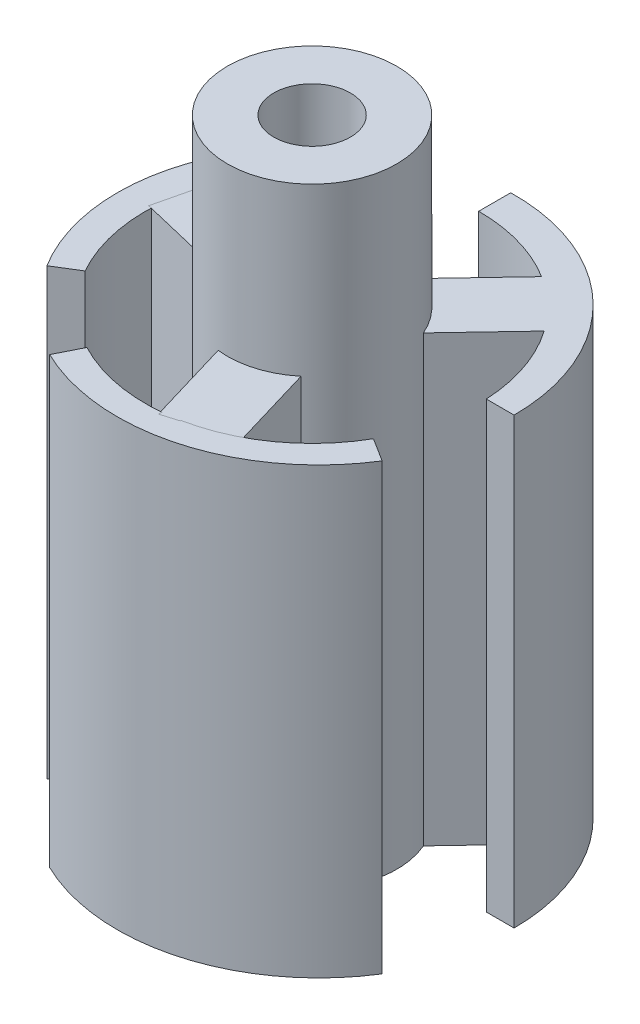
ISO-10303-21;
HEADER;
FILE_DESCRIPTION(('STEP AP214'),'2;1');
FILE_NAME('part.step','',(''),(''),'','','');
FILE_SCHEMA(('AUTOMOTIVE_DESIGN { 1 0 10303 214 1 1 1 1 }'));
ENDSEC;
DATA;
#1=APPLICATION_CONTEXT('core data for automotive mechanical design processes');
#2=APPLICATION_PROTOCOL_DEFINITION('international standard','automotive_design',2000,#1);
#3=PRODUCT_CONTEXT('',#1,'mechanical');
#4=PRODUCT('Part','Part','',(#3));
#5=PRODUCT_RELATED_PRODUCT_CATEGORY('part','',(#4));
#6=PRODUCT_DEFINITION_FORMATION('','',#4);
#7=PRODUCT_DEFINITION_CONTEXT('part definition',#1,'design');
#8=PRODUCT_DEFINITION('design','',#6,#7);
#9=PRODUCT_DEFINITION_SHAPE('','',#8);
#10=(LENGTH_UNIT() NAMED_UNIT(*) SI_UNIT(.MILLI.,.METRE.));
#11=(NAMED_UNIT(*) PLANE_ANGLE_UNIT() SI_UNIT($,.RADIAN.));
#12=(NAMED_UNIT(*) SI_UNIT($,.STERADIAN.) SOLID_ANGLE_UNIT());
#13=UNCERTAINTY_MEASURE_WITH_UNIT(LENGTH_MEASURE(1.E-05),#10,'distance_accuracy_value','');
#14=(GEOMETRIC_REPRESENTATION_CONTEXT(3) GLOBAL_UNCERTAINTY_ASSIGNED_CONTEXT((#13)) GLOBAL_UNIT_ASSIGNED_CONTEXT((#10,
#11,#12)) REPRESENTATION_CONTEXT('',''));
#15=CARTESIAN_POINT('',(0.,0.,0.));
#16=DIRECTION('',(0.,0.,1.));
#17=DIRECTION('',(1.,0.,0.));
#18=AXIS2_PLACEMENT_3D('',#15,#16,#17);
#19=CARTESIAN_POINT('',(0.,40.,-0.700234787448357));
#20=DIRECTION('',(-0.833300516288587,0.,0.552820268761172));
#21=DIRECTION('',(0.552820268761172,0.,0.833300516288587));
#22=AXIS2_PLACEMENT_3D('',#19,#20,#21);
#23=PLANE('',#22);
#24=DIRECTION('',(0.,-1.,0.));
#25=VECTOR('',#24,1.);
#26=CARTESIAN_POINT('',(-7.96696829436854,40.,-12.7093436571888));
#27=LINE('',#26,#25);
#28=CARTESIAN_POINT('',(-7.96696829436854,0.,-12.7093436571888));
#29=VERTEX_POINT('',#28);
#30=CARTESIAN_POINT('',(-7.96696829436854,40.,-12.7093436571888));
#31=VERTEX_POINT('',#30);
#32=EDGE_CURVE('E171',#29,#31,#27,.F.);
#33=ORIENTED_EDGE('',*,*,#32,.F.);
#34=DIRECTION('',(-0.552820268761172,0.,-0.833300516288587));
#35=VECTOR('',#34,1.);
#36=CARTESIAN_POINT('',(0.,0.,-0.700234787448357));
#37=LINE('',#36,#35);
#38=CARTESIAN_POINT('',(-9.34941361200224,0.,-14.793189822067));
#39=VERTEX_POINT('',#38);
#40=EDGE_CURVE('E13',#29,#39,#37,.T.);
#41=ORIENTED_EDGE('',*,*,#40,.T.);
#42=DIRECTION('',(0.,-1.,0.));
#43=VECTOR('',#42,1.);
#44=CARTESIAN_POINT('',(-9.34941361200224,40.,-14.793189822067));
#45=LINE('',#44,#43);
#46=CARTESIAN_POINT('',(-9.34941361200224,40.,-14.793189822067));
#47=VERTEX_POINT('',#46);
#48=EDGE_CURVE('E166',#47,#39,#45,.T.);
#49=ORIENTED_EDGE('',*,*,#48,.F.);
#50=DIRECTION('',(-0.552820268761172,0.,-0.833300516288587));
#51=VECTOR('',#50,1.);
#52=CARTESIAN_POINT('',(0.,40.,-0.700234787448357));
#53=LINE('',#52,#51);
#54=EDGE_CURVE('E125',#31,#47,#53,.T.);
#55=ORIENTED_EDGE('',*,*,#54,.F.);
#56=EDGE_LOOP('',(#33,#41,#49,#55));
#57=FACE_BOUND('',#56,.T.);
#58=ADVANCED_FACE('F121',(#57),#23,.F.);
#59=CARTESIAN_POINT('',(-15.1905349294899,40.,8.68893828703761));
#60=DIRECTION('',(-0.525767830062802,0.,-0.850628114319679));
#61=DIRECTION('',(-0.850628114319679,0.,0.525767830062802));
#62=AXIS2_PLACEMENT_3D('',#59,#60,#61);
#63=PLANE('',#62);
#64=DIRECTION('',(0.,-1.,0.));
#65=VECTOR('',#64,1.);
#66=CARTESIAN_POINT('',(-13.0625260727711,40.,7.37362954034011));
#67=LINE('',#66,#65);
#68=CARTESIAN_POINT('',(-13.0625260727711,40.,7.37362954034011));
#69=VERTEX_POINT('',#68);
#70=CARTESIAN_POINT('',(-13.0625260727711,0.,7.37362954034011));
#71=VERTEX_POINT('',#70);
#72=EDGE_CURVE('E138',#69,#71,#67,.T.);
#73=ORIENTED_EDGE('',*,*,#72,.F.);
#74=DIRECTION('',(0.850628114319679,0.,-0.525767830062802));
#75=VECTOR('',#74,1.);
#76=CARTESIAN_POINT('',(-15.1905349294899,40.,8.68893828703761));
#77=LINE('',#76,#75);
#78=CARTESIAN_POINT('',(-15.1905349294899,40.,8.68893828703761));
#79=VERTEX_POINT('',#78);
#80=EDGE_CURVE('E175',#79,#69,#77,.T.);
#81=ORIENTED_EDGE('',*,*,#80,.F.);
#82=DIRECTION('',(0.,-1.,0.));
#83=VECTOR('',#82,1.);
#84=CARTESIAN_POINT('',(-15.1905349294899,40.,8.68893828703761));
#85=LINE('',#84,#83);
#86=CARTESIAN_POINT('',(-15.1905349294899,0.,8.68893828703761));
#87=VERTEX_POINT('',#86);
#88=EDGE_CURVE('E170',#79,#87,#85,.T.);
#89=ORIENTED_EDGE('',*,*,#88,.T.);
#90=DIRECTION('',(0.850628114319679,0.,-0.525767830062802));
#91=VECTOR('',#90,1.);
#92=CARTESIAN_POINT('',(-15.1905349294899,0.,8.68893828703761));
#93=LINE('',#92,#91);
#94=EDGE_CURVE('E165',#87,#71,#93,.T.);
#95=ORIENTED_EDGE('',*,*,#94,.T.);
#96=EDGE_LOOP('',(#73,#81,#89,#95));
#97=FACE_BOUND('',#96,.T.);
#98=ADVANCED_FACE('F191',(#97),#63,.F.);
#99=CARTESIAN_POINT('',(-0.807800564734451,40.,-0.200938393531703));
#100=DIRECTION('',(0.,-1.,0.));
#101=DIRECTION('',(0.,0.,-1.));
#102=AXIS2_PLACEMENT_3D('',#99,#100,#101);
#103=CYLINDRICAL_SURFACE('',#102,16.9083693833216);
#104=CARTESIAN_POINT('',(-0.807800564734451,0.,-0.200938393531703));
#105=DIRECTION('',(0.,-1.,0.));
#106=DIRECTION('',(0.,0.,-1.));
#107=AXIS2_PLACEMENT_3D('',#104,#105,#106);
#108=CIRCLE('',#107,16.9083693833216);
#109=EDGE_CURVE('E130',#87,#39,#108,.T.);
#110=ORIENTED_EDGE('',*,*,#109,.F.);
#111=ORIENTED_EDGE('',*,*,#88,.F.);
#112=CARTESIAN_POINT('',(-0.807800564734451,40.,-0.200938393531703));
#113=DIRECTION('',(0.,-1.,0.));
#114=DIRECTION('',(0.,0.,-1.));
#115=AXIS2_PLACEMENT_3D('',#112,#113,#114);
#116=CIRCLE('',#115,16.9083693833216);
#117=EDGE_CURVE('E162',#79,#47,#116,.T.);
#118=ORIENTED_EDGE('',*,*,#117,.T.);
#119=ORIENTED_EDGE('',*,*,#48,.T.);
#120=EDGE_LOOP('',(#110,#111,#118,#119));
#121=FACE_BOUND('',#120,.T.);
#122=ADVANCED_FACE('F173',(#121),#103,.T.);
#123=CARTESIAN_POINT('',(-0.807800564734451,40.,-0.200938393531703));
#124=DIRECTION('',(0.,-1.,0.));
#125=DIRECTION('',(0.,0.,-1.));
#126=AXIS2_PLACEMENT_3D('',#123,#124,#125);
#127=PLANE('',#126);
#128=CARTESIAN_POINT('',(0.,40.,0.));
#129=DIRECTION('',(0.,1.,0.));
#130=DIRECTION('',(0.,0.,1.));
#131=AXIS2_PLACEMENT_3D('',#128,#129,#130);
#132=CIRCLE('',#131,15.);
#133=EDGE_CURVE('E164',#31,#69,#132,.T.);
#134=ORIENTED_EDGE('',*,*,#133,.F.);
#135=ORIENTED_EDGE('',*,*,#54,.T.);
#136=ORIENTED_EDGE('',*,*,#117,.F.);
#137=ORIENTED_EDGE('',*,*,#80,.T.);
#138=EDGE_LOOP('',(#134,#135,#136,#137));
#139=FACE_BOUND('',#138,.T.);
#140=ADVANCED_FACE('F123',(#139),#127,.F.);
#141=CARTESIAN_POINT('',(-0.807800564734451,0.,-0.200938393531703));
#142=DIRECTION('',(0.,-1.,0.));
#143=DIRECTION('',(0.,0.,-1.));
#144=AXIS2_PLACEMENT_3D('',#141,#142,#143);
#145=PLANE('',#144);
#146=ORIENTED_EDGE('',*,*,#40,.F.);
#147=CARTESIAN_POINT('',(0.,0.,0.));
#148=DIRECTION('',(0.,1.,0.));
#149=DIRECTION('',(0.,0.,1.));
#150=AXIS2_PLACEMENT_3D('',#147,#148,#149);
#151=CIRCLE('',#150,15.);
#152=EDGE_CURVE('E185',#29,#71,#151,.T.);
#153=ORIENTED_EDGE('',*,*,#152,.T.);
#154=ORIENTED_EDGE('',*,*,#94,.F.);
#155=ORIENTED_EDGE('',*,*,#109,.T.);
#156=EDGE_LOOP('',(#146,#153,#154,#155));
#157=FACE_BOUND('',#156,.T.);
#158=ADVANCED_FACE('F194',(#157),#145,.T.);
#159=CARTESIAN_POINT('',(0.,40.,0.));
#160=DIRECTION('',(0.,-1.,0.));
#161=DIRECTION('',(0.,0.,-1.));
#162=AXIS2_PLACEMENT_3D('',#159,#160,#161);
#163=CYLINDRICAL_SURFACE('',#162,15.);
#164=ORIENTED_EDGE('',*,*,#32,.T.);
#165=ORIENTED_EDGE('',*,*,#133,.T.);
#166=ORIENTED_EDGE('',*,*,#72,.T.);
#167=ORIENTED_EDGE('',*,*,#152,.F.);
#168=EDGE_LOOP('',(#164,#165,#166,#167));
#169=FACE_BOUND('',#168,.T.);
#170=ADVANCED_FACE('F188',(#169),#163,.F.);
#171=CLOSED_SHELL('',(#58,#98,#122,#140,#158,#170));
#172=MANIFOLD_SOLID_BREP('B2',#171);
#173=CARTESIAN_POINT('',(0.301930105193301,40.,-0.700234787448357));
#174=DIRECTION('',(0.,1.,0.));
#175=DIRECTION('',(0.,0.,1.));
#176=AXIS2_PLACEMENT_3D('',#173,#174,#175);
#177=PLANE('',#176);
#178=DIRECTION('',(0.972536719561617,0.,0.232749498612412));
#179=VECTOR('',#178,1.);
#180=CARTESIAN_POINT('',(-0.698248495837229,40.,2.91761015868482));
#181=LINE('',#180,#179);
#182=CARTESIAN_POINT('',(-15.2862992892615,40.,-0.573632320501362));
#183=VERTEX_POINT('',#182);
#184=CARTESIAN_POINT('',(-7.51576731796803,40.,1.28602745777982));
#185=VERTEX_POINT('',#184);
#186=EDGE_CURVE('E388',#183,#185,#181,.T.);
#187=ORIENTED_EDGE('',*,*,#186,.T.);
#188=CARTESIAN_POINT('',(0.,40.,0.));
#189=DIRECTION('',(0.,1.,0.));
#190=DIRECTION('',(0.,0.,1.));
#191=AXIS2_PLACEMENT_3D('',#188,#189,#190);
#192=CIRCLE('',#191,7.625);
#193=CARTESIAN_POINT('',(-6.11927032629356,40.,-4.54919285958983));
#194=VERTEX_POINT('',#193);
#195=EDGE_CURVE('E517',#185,#194,#192,.F.);
#196=ORIENTED_EDGE('',*,*,#195,.T.);
#197=DIRECTION('',(0.972536719561615,0.,0.232749498612419));
#198=VECTOR('',#197,1.);
#199=CARTESIAN_POINT('',(0.698248495837243,40.,-2.91761015868479));
#200=LINE('',#199,#198);
#201=CARTESIAN_POINT('',(-13.889802297587,40.,-6.40885263787108));
#202=VERTEX_POINT('',#201);
#203=EDGE_CURVE('E402',#202,#194,#200,.T.);
#204=ORIENTED_EDGE('',*,*,#203,.F.);
#205=DIRECTION('',(-0.232749498612407,0.,0.972536719561618));
#206=VECTOR('',#205,1.);
#207=CARTESIAN_POINT('',(-14.5880507934243,40.,-3.4912424791861));
#208=LINE('',#207,#206);
#209=EDGE_CURVE('E405',#202,#183,#208,.T.);
#210=ORIENTED_EDGE('',*,*,#209,.T.);
#211=EDGE_LOOP('',(#187,#196,#204,#210));
#212=FACE_BOUND('',#211,.T.);
#213=ADVANCED_FACE('F254',(#212),#177,.T.);
#214=DIRECTION('',(-0.68783533829725,0.,0.725866755947335));
#215=VECTOR('',#214,1.);
#216=CARTESIAN_POINT('',(-2.177600267842,40.,-2.06350601489175));
#217=LINE('',#216,#215);
#218=CARTESIAN_POINT('',(7.93147336745547,40.,-12.7315250548135));
#219=VERTEX_POINT('',#218);
#220=CARTESIAN_POINT('',(2.64415121058236,40.,-7.15185915518307));
#221=VERTEX_POINT('',#220);
#222=EDGE_CURVE('E399',#219,#221,#217,.T.);
#223=ORIENTED_EDGE('',*,*,#222,.T.);
#224=CARTESIAN_POINT('',(6.99935174626637,40.,-3.02484712539956));
#225=VERTEX_POINT('',#224);
#226=EDGE_CURVE('E473',#221,#225,#192,.F.);
#227=ORIENTED_EDGE('',*,*,#226,.T.);
#228=DIRECTION('',(-0.687835338297251,0.,0.725866755947334));
#229=VECTOR('',#228,1.);
#230=CARTESIAN_POINT('',(2.17760026784201,40.,2.06350601489176));
#231=LINE('',#230,#229);
#232=CARTESIAN_POINT('',(12.2866739031395,40.,-8.60451302503002));
#233=VERTEX_POINT('',#232);
#234=EDGE_CURVE('E396',#233,#225,#231,.T.);
#235=ORIENTED_EDGE('',*,*,#234,.F.);
#236=CARTESIAN_POINT('',(0.,40.,0.));
#237=DIRECTION('',(0.,1.,0.));
#238=DIRECTION('',(0.,0.,1.));
#239=AXIS2_PLACEMENT_3D('',#236,#237,#238);
#240=CIRCLE('',#239,15.);
#241=CARTESIAN_POINT('',(14.9836467938365,40.,-0.700234787448357));
#242=VERTEX_POINT('',#241);
#243=EDGE_CURVE('E428',#242,#233,#240,.T.);
#244=ORIENTED_EDGE('',*,*,#243,.F.);
#245=DIRECTION('',(1.,0.,0.));
#246=VECTOR('',#245,1.);
#247=CARTESIAN_POINT('',(0.,40.,-0.700234787448357));
#248=LINE('',#247,#246);
#249=CARTESIAN_POINT('',(17.4859849949166,40.,-0.700234787448357));
#250=VERTEX_POINT('',#249);
#251=EDGE_CURVE('E444',#242,#250,#248,.T.);
#252=ORIENTED_EDGE('',*,*,#251,.T.);
#253=CARTESIAN_POINT('',(0.301930105193301,40.,-0.700234787448357));
#254=DIRECTION('',(0.,1.,0.));
#255=DIRECTION('',(0.,0.,1.));
#256=AXIS2_PLACEMENT_3D('',#253,#254,#255);
#257=CIRCLE('',#256,17.1840548897233);
#258=CARTESIAN_POINT('',(0.,40.,-17.8816369614445));
#259=VERTEX_POINT('',#258);
#260=EDGE_CURVE('E457',#250,#259,#257,.T.);
#261=ORIENTED_EDGE('',*,*,#260,.T.);
#262=DIRECTION('',(0.,0.,-1.));
#263=VECTOR('',#262,1.);
#264=CARTESIAN_POINT('',(0.,40.,-0.700234787448357));
#265=LINE('',#264,#263);
#266=CARTESIAN_POINT('',(0.,40.,-15.));
#267=VERTEX_POINT('',#266);
#268=EDGE_CURVE('E450',#267,#259,#265,.T.);
#269=ORIENTED_EDGE('',*,*,#268,.F.);
#270=EDGE_CURVE('E432',#219,#267,#240,.T.);
#271=ORIENTED_EDGE('',*,*,#270,.F.);
#272=EDGE_LOOP('',(#223,#227,#235,#244,#252,#261,#269,#271));
#273=FACE_BOUND('',#272,.T.);
#274=ADVANCED_FACE('F470',(#273),#177,.T.);
#275=CARTESIAN_POINT('',(2.87584876367925,40.,-0.854104143793098));
#276=DIRECTION('',(-0.95861625455975,0.,0.284701381264366));
#277=DIRECTION('',(0.284701381264366,0.,0.95861625455975));
#278=AXIS2_PLACEMENT_3D('',#275,#276,#277);
#279=PLANE('',#278);
#280=DIRECTION('',(0.,-1.,0.));
#281=VECTOR('',#280,1.);
#282=CARTESIAN_POINT('',(4.87161610738568,55.,5.86583169740323));
#283=LINE('',#282,#281);
#284=CARTESIAN_POINT('',(4.87161610738568,40.,5.86583169740323));
#285=VERTEX_POINT('',#284);
#286=CARTESIAN_POINT('',(4.87161610738568,0.,5.86583169740323));
#287=VERTEX_POINT('',#286);
#288=EDGE_CURVE('E269',#285,#287,#283,.T.);
#289=ORIENTED_EDGE('',*,*,#288,.F.);
#290=DIRECTION('',(-0.284701381264366,0.,-0.958616254559749));
#291=VECTOR('',#290,1.);
#292=CARTESIAN_POINT('',(2.87584876367925,40.,-0.854104143793098));
#293=LINE('',#292,#291);
#294=CARTESIAN_POINT('',(7.14636948264473,40.,13.5251396746031));
#295=VERTEX_POINT('',#294);
#296=EDGE_CURVE('E384',#295,#285,#293,.T.);
#297=ORIENTED_EDGE('',*,*,#296,.F.);
#298=DIRECTION('',(0.,-1.,0.));
#299=VECTOR('',#298,1.);
#300=CARTESIAN_POINT('',(7.14636948264473,40.,13.5251396746031));
#301=LINE('',#300,#299);
#302=CARTESIAN_POINT('',(7.14636948264473,0.,13.5251396746031));
#303=VERTEX_POINT('',#302);
#304=EDGE_CURVE('E378',#295,#303,#301,.T.);
#305=ORIENTED_EDGE('',*,*,#304,.T.);
#306=DIRECTION('',(-0.284701381264366,0.,-0.958616254559749));
#307=VECTOR('',#306,1.);
#308=CARTESIAN_POINT('',(2.87584876367925,0.,-0.854104143793098));
#309=LINE('',#308,#307);
#310=EDGE_CURVE('E274',#303,#287,#309,.T.);
#311=ORIENTED_EDGE('',*,*,#310,.T.);
#312=EDGE_LOOP('',(#289,#297,#305,#311));
#313=FACE_BOUND('',#312,.T.);
#314=ADVANCED_FACE('F529',(#313),#279,.F.);
#315=CARTESIAN_POINT('',(-2.87584876367925,40.,0.854104143793097));
#316=DIRECTION('',(-0.95861625455975,0.,0.284701381264365));
#317=DIRECTION('',(0.284701381264365,0.,0.95861625455975));
#318=AXIS2_PLACEMENT_3D('',#315,#316,#317);
#319=PLANE('',#318);
#320=DIRECTION('',(-0.284701381264365,0.,-0.95861625455975));
#321=VECTOR('',#320,1.);
#322=CARTESIAN_POINT('',(-2.87584876367925,40.,0.854104143793097));
#323=LINE('',#322,#321);
#324=CARTESIAN_POINT('',(1.39467195528624,40.,15.2333479621894));
#325=VERTEX_POINT('',#324);
#326=CARTESIAN_POINT('',(-0.88008141997283,40.,7.57403998498943));
#327=VERTEX_POINT('',#326);
#328=EDGE_CURVE('E371',#325,#327,#323,.T.);
#329=ORIENTED_EDGE('',*,*,#328,.T.);
#330=DIRECTION('',(0.,-1.,0.));
#331=VECTOR('',#330,1.);
#332=CARTESIAN_POINT('',(-0.880081419972831,55.,7.57403998498942));
#333=LINE('',#332,#331);
#334=CARTESIAN_POINT('',(-0.88008141997283,0.,7.57403998498943));
#335=VERTEX_POINT('',#334);
#336=EDGE_CURVE('E525',#327,#335,#333,.T.);
#337=ORIENTED_EDGE('',*,*,#336,.T.);
#338=DIRECTION('',(-0.284701381264365,0.,-0.95861625455975));
#339=VECTOR('',#338,1.);
#340=CARTESIAN_POINT('',(-2.87584876367925,0.,0.854104143793097));
#341=LINE('',#340,#339);
#342=CARTESIAN_POINT('',(1.39467195528624,0.,15.2333479621894));
#343=VERTEX_POINT('',#342);
#344=EDGE_CURVE('E374',#343,#335,#341,.T.);
#345=ORIENTED_EDGE('',*,*,#344,.F.);
#346=DIRECTION('',(0.,-1.,0.));
#347=VECTOR('',#346,1.);
#348=CARTESIAN_POINT('',(1.39467195528624,40.,15.2333479621894));
#349=LINE('',#348,#347);
#350=EDGE_CURVE('E367',#325,#343,#349,.T.);
#351=ORIENTED_EDGE('',*,*,#350,.F.);
#352=EDGE_LOOP('',(#329,#337,#345,#351));
#353=FACE_BOUND('',#352,.T.);
#354=ADVANCED_FACE('F369',(#353),#319,.T.);
#355=CARTESIAN_POINT('',(2.17760026784201,40.,2.06350601489176));
#356=DIRECTION('',(0.725866755947334,0.,0.687835338297251));
#357=DIRECTION('',(0.687835338297251,0.,-0.725866755947334));
#358=AXIS2_PLACEMENT_3D('',#355,#356,#357);
#359=PLANE('',#358);
#360=ORIENTED_EDGE('',*,*,#234,.T.);
#361=DIRECTION('',(0.,-1.,0.));
#362=VECTOR('',#361,1.);
#363=CARTESIAN_POINT('',(6.99935174626637,55.,-3.02484712539956));
#364=LINE('',#363,#362);
#365=CARTESIAN_POINT('',(6.99935174626637,0.,-3.02484712539956));
#366=VERTEX_POINT('',#365);
#367=EDGE_CURVE('E523',#225,#366,#364,.T.);
#368=ORIENTED_EDGE('',*,*,#367,.T.);
#369=DIRECTION('',(-0.687835338297251,0.,0.725866755947334));
#370=VECTOR('',#369,1.);
#371=CARTESIAN_POINT('',(2.17760026784201,0.,2.06350601489176));
#372=LINE('',#371,#370);
#373=CARTESIAN_POINT('',(12.2866739031395,0.,-8.60451302503002));
#374=VERTEX_POINT('',#373);
#375=EDGE_CURVE('E414',#374,#366,#372,.T.);
#376=ORIENTED_EDGE('',*,*,#375,.F.);
#377=DIRECTION('',(0.,-1.,0.));
#378=VECTOR('',#377,1.);
#379=CARTESIAN_POINT('',(12.2866739031395,40.,-8.60451302503002));
#380=LINE('',#379,#378);
#381=EDGE_CURVE('E262',#374,#233,#380,.F.);
#382=ORIENTED_EDGE('',*,*,#381,.T.);
#383=EDGE_LOOP('',(#360,#368,#376,#382));
#384=FACE_BOUND('',#383,.T.);
#385=ADVANCED_FACE('F465',(#384),#359,.T.);
#386=CARTESIAN_POINT('',(-2.177600267842,40.,-2.06350601489175));
#387=DIRECTION('',(0.725866755947335,0.,0.68783533829725));
#388=DIRECTION('',(0.68783533829725,0.,-0.725866755947335));
#389=AXIS2_PLACEMENT_3D('',#386,#387,#388);
#390=PLANE('',#389);
#391=DIRECTION('',(0.,-1.,0.));
#392=VECTOR('',#391,1.);
#393=CARTESIAN_POINT('',(2.64415121058236,55.,-7.15185915518307));
#394=LINE('',#393,#392);
#395=CARTESIAN_POINT('',(2.64415121058236,0.,-7.15185915518307));
#396=VERTEX_POINT('',#395);
#397=EDGE_CURVE('E521',#221,#396,#394,.T.);
#398=ORIENTED_EDGE('',*,*,#397,.F.);
#399=ORIENTED_EDGE('',*,*,#222,.F.);
#400=DIRECTION('',(0.,-1.,0.));
#401=VECTOR('',#400,1.);
#402=CARTESIAN_POINT('',(7.93147336745547,40.,-12.7315250548135));
#403=LINE('',#402,#401);
#404=CARTESIAN_POINT('',(7.93147336745547,0.,-12.7315250548135));
#405=VERTEX_POINT('',#404);
#406=EDGE_CURVE('E455',#405,#219,#403,.F.);
#407=ORIENTED_EDGE('',*,*,#406,.F.);
#408=DIRECTION('',(-0.68783533829725,0.,0.725866755947335));
#409=VECTOR('',#408,1.);
#410=CARTESIAN_POINT('',(-2.177600267842,0.,-2.06350601489175));
#411=LINE('',#410,#409);
#412=EDGE_CURVE('E417',#405,#396,#411,.T.);
#413=ORIENTED_EDGE('',*,*,#412,.T.);
#414=EDGE_LOOP('',(#398,#399,#407,#413));
#415=FACE_BOUND('',#414,.T.);
#416=ADVANCED_FACE('F498',(#415),#390,.F.);
#417=CARTESIAN_POINT('',(0.698248495837243,40.,-2.91761015868479));
#418=DIRECTION('',(0.232749498612419,0.,-0.972536719561615));
#419=DIRECTION('',(-0.972536719561615,0.,-0.232749498612419));
#420=AXIS2_PLACEMENT_3D('',#417,#418,#419);
#421=PLANE('',#420);
#422=ORIENTED_EDGE('',*,*,#203,.T.);
#423=DIRECTION('',(0.,-1.,0.));
#424=VECTOR('',#423,1.);
#425=CARTESIAN_POINT('',(-6.11927032629356,55.,-4.54919285958983));
#426=LINE('',#425,#424);
#427=CARTESIAN_POINT('',(-6.11927032629356,0.,-4.54919285958983));
#428=VERTEX_POINT('',#427);
#429=EDGE_CURVE('E519',#194,#428,#426,.T.);
#430=ORIENTED_EDGE('',*,*,#429,.T.);
#431=DIRECTION('',(0.972536719561615,0.,0.232749498612419));
#432=VECTOR('',#431,1.);
#433=CARTESIAN_POINT('',(0.698248495837243,0.,-2.91761015868479));
#434=LINE('',#433,#432);
#435=CARTESIAN_POINT('',(-13.889802297587,0.,-6.40885263787108));
#436=VERTEX_POINT('',#435);
#437=EDGE_CURVE('E419',#436,#428,#434,.T.);
#438=ORIENTED_EDGE('',*,*,#437,.F.);
#439=DIRECTION('',(0.,-1.,0.));
#440=VECTOR('',#439,1.);
#441=CARTESIAN_POINT('',(-13.889802297587,40.,-6.40885263787108));
#442=LINE('',#441,#440);
#443=EDGE_CURVE('E425',#202,#436,#442,.T.);
#444=ORIENTED_EDGE('',*,*,#443,.F.);
#445=EDGE_LOOP('',(#422,#430,#438,#444));
#446=FACE_BOUND('',#445,.T.);
#447=ADVANCED_FACE('F563',(#446),#421,.T.);
#448=CARTESIAN_POINT('',(-0.698248495837229,40.,2.91761015868482));
#449=DIRECTION('',(0.232749498612412,0.,-0.972536719561617));
#450=DIRECTION('',(-0.972536719561617,0.,-0.232749498612412));
#451=AXIS2_PLACEMENT_3D('',#448,#449,#450);
#452=PLANE('',#451);
#453=DIRECTION('',(0.,-1.,0.));
#454=VECTOR('',#453,1.);
#455=CARTESIAN_POINT('',(-7.51576731796803,55.,1.28602745777982));
#456=LINE('',#455,#454);
#457=CARTESIAN_POINT('',(-7.51576731796803,0.,1.28602745777982));
#458=VERTEX_POINT('',#457);
#459=EDGE_CURVE('E119',#185,#458,#456,.T.);
#460=ORIENTED_EDGE('',*,*,#459,.F.);
#461=ORIENTED_EDGE('',*,*,#186,.F.);
#462=DIRECTION('',(0.,-1.,0.));
#463=VECTOR('',#462,1.);
#464=CARTESIAN_POINT('',(-15.2862992892615,40.,-0.573632320501362));
#465=LINE('',#464,#463);
#466=CARTESIAN_POINT('',(-15.2862992892615,0.,-0.573632320501362));
#467=VERTEX_POINT('',#466);
#468=EDGE_CURVE('E407',#183,#467,#465,.T.);
#469=ORIENTED_EDGE('',*,*,#468,.T.);
#470=DIRECTION('',(0.972536719561617,0.,0.232749498612412));
#471=VECTOR('',#470,1.);
#472=CARTESIAN_POINT('',(-0.698248495837229,0.,2.91761015868482));
#473=LINE('',#472,#471);
#474=EDGE_CURVE('E408',#467,#458,#473,.T.);
#475=ORIENTED_EDGE('',*,*,#474,.T.);
#476=EDGE_LOOP('',(#460,#461,#469,#475));
#477=FACE_BOUND('',#476,.T.);
#478=ADVANCED_FACE('F566',(#477),#452,.F.);
#479=CARTESIAN_POINT('',(0.,40.,0.));
#480=DIRECTION('',(0.,-1.,0.));
#481=DIRECTION('',(0.,0.,-1.));
#482=AXIS2_PLACEMENT_3D('',#479,#480,#481);
#483=CYLINDRICAL_SURFACE('',#482,15.);
#484=ORIENTED_EDGE('',*,*,#381,.F.);
#485=CARTESIAN_POINT('',(0.,0.,0.));
#486=DIRECTION('',(0.,1.,0.));
#487=DIRECTION('',(0.,0.,1.));
#488=AXIS2_PLACEMENT_3D('',#485,#486,#487);
#489=CIRCLE('',#488,15.);
#490=CARTESIAN_POINT('',(14.9836467938365,0.,-0.700234787448357));
#491=VERTEX_POINT('',#490);
#492=EDGE_CURVE('E433',#491,#374,#489,.T.);
#493=ORIENTED_EDGE('',*,*,#492,.F.);
#494=DIRECTION('',(0.,-1.,0.));
#495=VECTOR('',#494,1.);
#496=CARTESIAN_POINT('',(14.9836467938365,40.,-0.700234787448357));
#497=LINE('',#496,#495);
#498=EDGE_CURVE('E431',#491,#242,#497,.F.);
#499=ORIENTED_EDGE('',*,*,#498,.T.);
#500=ORIENTED_EDGE('',*,*,#243,.T.);
#501=EDGE_LOOP('',(#484,#493,#499,#500));
#502=FACE_BOUND('',#501,.T.);
#503=ADVANCED_FACE('F474',(#502),#483,.F.);
#504=CARTESIAN_POINT('',(0.,0.,-15.));
#505=VERTEX_POINT('',#504);
#506=EDGE_CURVE('E377',#405,#505,#489,.T.);
#507=ORIENTED_EDGE('',*,*,#506,.F.);
#508=ORIENTED_EDGE('',*,*,#406,.T.);
#509=ORIENTED_EDGE('',*,*,#270,.T.);
#510=DIRECTION('',(0.,-1.,0.));
#511=VECTOR('',#510,1.);
#512=CARTESIAN_POINT('',(0.,40.,-15.));
#513=LINE('',#512,#511);
#514=EDGE_CURVE('E437',#505,#267,#513,.F.);
#515=ORIENTED_EDGE('',*,*,#514,.F.);
#516=EDGE_LOOP('',(#507,#508,#509,#515));
#517=FACE_BOUND('',#516,.T.);
#518=ADVANCED_FACE('F495',(#517),#483,.F.);
#519=CARTESIAN_POINT('',(0.,40.,-0.700234787448357));
#520=DIRECTION('',(-1.,0.,0.));
#521=DIRECTION('',(0.,0.,1.));
#522=AXIS2_PLACEMENT_3D('',#519,#520,#521);
#523=PLANE('',#522);
#524=DIRECTION('',(0.,0.,-1.));
#525=VECTOR('',#524,1.);
#526=CARTESIAN_POINT('',(0.,0.,-0.700234787448357));
#527=LINE('',#526,#525);
#528=CARTESIAN_POINT('',(0.,0.,-17.8816369614445));
#529=VERTEX_POINT('',#528);
#530=EDGE_CURVE('E453',#505,#529,#527,.T.);
#531=ORIENTED_EDGE('',*,*,#530,.F.);
#532=ORIENTED_EDGE('',*,*,#514,.T.);
#533=ORIENTED_EDGE('',*,*,#268,.T.);
#534=DIRECTION('',(0.,-1.,0.));
#535=VECTOR('',#534,1.);
#536=CARTESIAN_POINT('',(0.,40.,-17.8816369614445));
#537=LINE('',#536,#535);
#538=EDGE_CURVE('E441',#259,#529,#537,.T.);
#539=ORIENTED_EDGE('',*,*,#538,.T.);
#540=EDGE_LOOP('',(#531,#532,#533,#539));
#541=FACE_BOUND('',#540,.T.);
#542=ADVANCED_FACE('F491',(#541),#523,.T.);
#543=CARTESIAN_POINT('',(0.,40.,-0.700234787448357));
#544=DIRECTION('',(0.,0.,-1.));
#545=DIRECTION('',(-1.,0.,0.));
#546=AXIS2_PLACEMENT_3D('',#543,#544,#545);
#547=PLANE('',#546);
#548=ORIENTED_EDGE('',*,*,#498,.F.);
#549=DIRECTION('',(1.,0.,0.));
#550=VECTOR('',#549,1.);
#551=CARTESIAN_POINT('',(0.,0.,-0.700234787448357));
#552=LINE('',#551,#550);
#553=CARTESIAN_POINT('',(17.4859849949166,0.,-0.700234787448357));
#554=VERTEX_POINT('',#553);
#555=EDGE_CURVE('E447',#491,#554,#552,.T.);
#556=ORIENTED_EDGE('',*,*,#555,.T.);
#557=DIRECTION('',(0.,-1.,0.));
#558=VECTOR('',#557,1.);
#559=CARTESIAN_POINT('',(17.4859849949166,40.,-0.700234787448357));
#560=LINE('',#559,#558);
#561=EDGE_CURVE('E440',#250,#554,#560,.T.);
#562=ORIENTED_EDGE('',*,*,#561,.F.);
#563=ORIENTED_EDGE('',*,*,#251,.F.);
#564=EDGE_LOOP('',(#548,#556,#562,#563));
#565=FACE_BOUND('',#564,.T.);
#566=ADVANCED_FACE('F478',(#565),#547,.F.);
#567=CARTESIAN_POINT('',(0.301930105193301,40.,-0.700234787448357));
#568=DIRECTION('',(0.,-1.,0.));
#569=DIRECTION('',(0.,0.,-1.));
#570=AXIS2_PLACEMENT_3D('',#567,#568,#569);
#571=CYLINDRICAL_SURFACE('',#570,17.1840548897233);
#572=CARTESIAN_POINT('',(0.301930105193301,0.,-0.700234787448357));
#573=DIRECTION('',(0.,1.,0.));
#574=DIRECTION('',(0.,0.,1.));
#575=AXIS2_PLACEMENT_3D('',#572,#573,#574);
#576=CIRCLE('',#575,17.1840548897233);
#577=EDGE_CURVE('E449',#554,#529,#576,.T.);
#578=ORIENTED_EDGE('',*,*,#577,.T.);
#579=ORIENTED_EDGE('',*,*,#538,.F.);
#580=ORIENTED_EDGE('',*,*,#260,.F.);
#581=ORIENTED_EDGE('',*,*,#561,.T.);
#582=EDGE_LOOP('',(#578,#579,#580,#581));
#583=FACE_BOUND('',#582,.T.);
#584=ADVANCED_FACE('F486',(#583),#571,.T.);
#585=ORIENTED_EDGE('',*,*,#296,.T.);
#586=EDGE_CURVE('E387',#285,#327,#192,.F.);
#587=ORIENTED_EDGE('',*,*,#586,.T.);
#588=ORIENTED_EDGE('',*,*,#328,.F.);
#589=DIRECTION('',(0.958616254559747,0.,-0.284701381264373));
#590=VECTOR('',#589,1.);
#591=CARTESIAN_POINT('',(4.2705207189656,40.,14.3792438183962));
#592=LINE('',#591,#590);
#593=EDGE_CURVE('E381',#325,#295,#592,.T.);
#594=ORIENTED_EDGE('',*,*,#593,.T.);
#595=EDGE_LOOP('',(#585,#587,#588,#594));
#596=FACE_BOUND('',#595,.T.);
#597=ADVANCED_FACE('F256',(#596),#177,.T.);
#598=CARTESIAN_POINT('',(0.301930105193301,0.,-0.700234787448357));
#599=DIRECTION('',(0.,1.,0.));
#600=DIRECTION('',(0.,0.,1.));
#601=AXIS2_PLACEMENT_3D('',#598,#599,#600);
#602=PLANE('',#601);
#603=CARTESIAN_POINT('',(0.,0.,0.));
#604=DIRECTION('',(0.,1.,0.));
#605=DIRECTION('',(0.,0.,1.));
#606=AXIS2_PLACEMENT_3D('',#603,#604,#605);
#607=CIRCLE('',#606,3.45);
#608=CARTESIAN_POINT('',(0.,0.,3.45));
#609=VERTEX_POINT('',#608);
#610=EDGE_CURVE('E694',#609,#609,#607,.T.);
#611=ORIENTED_EDGE('',*,*,#610,.T.);
#612=EDGE_LOOP('',(#611));
#613=FACE_BOUND('',#612,.T.);
#614=ORIENTED_EDGE('',*,*,#344,.T.);
#615=CARTESIAN_POINT('',(0.,0.,0.));
#616=DIRECTION('',(0.,1.,0.));
#617=DIRECTION('',(0.,0.,1.));
#618=AXIS2_PLACEMENT_3D('',#615,#616,#617);
#619=CIRCLE('',#618,7.625);
#620=EDGE_CURVE('E508',#458,#335,#619,.T.);
#621=ORIENTED_EDGE('',*,*,#620,.F.);
#622=ORIENTED_EDGE('',*,*,#474,.F.);
#623=DIRECTION('',(-0.232749498612407,0.,0.972536719561618));
#624=VECTOR('',#623,1.);
#625=CARTESIAN_POINT('',(-14.5880507934243,0.,-3.4912424791861));
#626=LINE('',#625,#624);
#627=EDGE_CURVE('E391',#436,#467,#626,.T.);
#628=ORIENTED_EDGE('',*,*,#627,.F.);
#629=ORIENTED_EDGE('',*,*,#437,.T.);
#630=EDGE_CURVE('E502',#396,#428,#619,.T.);
#631=ORIENTED_EDGE('',*,*,#630,.F.);
#632=ORIENTED_EDGE('',*,*,#412,.F.);
#633=ORIENTED_EDGE('',*,*,#506,.T.);
#634=ORIENTED_EDGE('',*,*,#530,.T.);
#635=ORIENTED_EDGE('',*,*,#577,.F.);
#636=ORIENTED_EDGE('',*,*,#555,.F.);
#637=ORIENTED_EDGE('',*,*,#492,.T.);
#638=ORIENTED_EDGE('',*,*,#375,.T.);
#639=EDGE_CURVE('E507',#287,#366,#619,.T.);
#640=ORIENTED_EDGE('',*,*,#639,.F.);
#641=ORIENTED_EDGE('',*,*,#310,.F.);
#642=DIRECTION('',(0.958616254559747,0.,-0.284701381264373));
#643=VECTOR('',#642,1.);
#644=CARTESIAN_POINT('',(4.2705207189656,0.,14.3792438183962));
#645=LINE('',#644,#643);
#646=EDGE_CURVE('E411',#343,#303,#645,.T.);
#647=ORIENTED_EDGE('',*,*,#646,.F.);
#648=EDGE_LOOP('',(#614,#621,#622,#628,#629,#631,#632,#633,#634,#635,#636,#637,#638,#640,#641,#647));
#649=FACE_BOUND('',#648,.T.);
#650=ADVANCED_FACE('F482',(#613,#649),#602,.F.);
#651=CARTESIAN_POINT('',(4.2705207189656,40.,14.3792438183962));
#652=DIRECTION('',(-0.284701381264373,0.,-0.958616254559747));
#653=DIRECTION('',(-0.958616254559747,0.,0.284701381264373));
#654=AXIS2_PLACEMENT_3D('',#651,#652,#653);
#655=PLANE('',#654);
#656=ORIENTED_EDGE('',*,*,#646,.T.);
#657=ORIENTED_EDGE('',*,*,#304,.F.);
#658=ORIENTED_EDGE('',*,*,#593,.F.);
#659=ORIENTED_EDGE('',*,*,#350,.T.);
#660=EDGE_LOOP('',(#656,#657,#658,#659));
#661=FACE_BOUND('',#660,.T.);
#662=ADVANCED_FACE('F382',(#661),#655,.F.);
#663=CARTESIAN_POINT('',(-14.5880507934243,40.,-3.4912424791861));
#664=DIRECTION('',(0.972536719561618,0.,0.232749498612407));
#665=DIRECTION('',(0.232749498612407,0.,-0.972536719561618));
#666=AXIS2_PLACEMENT_3D('',#663,#664,#665);
#667=PLANE('',#666);
#668=ORIENTED_EDGE('',*,*,#627,.T.);
#669=ORIENTED_EDGE('',*,*,#468,.F.);
#670=ORIENTED_EDGE('',*,*,#209,.F.);
#671=ORIENTED_EDGE('',*,*,#443,.T.);
#672=EDGE_LOOP('',(#668,#669,#670,#671));
#673=FACE_BOUND('',#672,.T.);
#674=ADVANCED_FACE('F544',(#673),#667,.F.);
#675=CARTESIAN_POINT('',(0.,55.,0.));
#676=DIRECTION('',(0.,-1.,0.));
#677=DIRECTION('',(0.,0.,-1.));
#678=AXIS2_PLACEMENT_3D('',#675,#676,#677);
#679=CYLINDRICAL_SURFACE('',#678,7.625);
#680=CARTESIAN_POINT('',(0.,55.,0.));
#681=DIRECTION('',(0.,1.,0.));
#682=DIRECTION('',(0.,0.,1.));
#683=AXIS2_PLACEMENT_3D('',#680,#681,#682);
#684=CIRCLE('',#683,7.625);
#685=CARTESIAN_POINT('',(0.,55.,7.625));
#686=VERTEX_POINT('',#685);
#687=EDGE_CURVE('E511',#686,#686,#684,.T.);
#688=ORIENTED_EDGE('',*,*,#687,.F.);
#689=EDGE_LOOP('',(#688));
#690=FACE_BOUND('',#689,.T.);
#691=ORIENTED_EDGE('',*,*,#586,.F.);
#692=ORIENTED_EDGE('',*,*,#288,.T.);
#693=ORIENTED_EDGE('',*,*,#639,.T.);
#694=ORIENTED_EDGE('',*,*,#367,.F.);
#695=ORIENTED_EDGE('',*,*,#226,.F.);
#696=ORIENTED_EDGE('',*,*,#397,.T.);
#697=ORIENTED_EDGE('',*,*,#630,.T.);
#698=ORIENTED_EDGE('',*,*,#429,.F.);
#699=ORIENTED_EDGE('',*,*,#195,.F.);
#700=ORIENTED_EDGE('',*,*,#459,.T.);
#701=ORIENTED_EDGE('',*,*,#620,.T.);
#702=ORIENTED_EDGE('',*,*,#336,.F.);
#703=EDGE_LOOP('',(#691,#692,#693,#694,#695,#696,#697,#698,#699,#700,#701,#702));
#704=FACE_BOUND('',#703,.T.);
#705=ADVANCED_FACE('F527',(#690,#704),#679,.T.);
#706=CARTESIAN_POINT('',(0.,55.,0.));
#707=DIRECTION('',(0.,1.,0.));
#708=DIRECTION('',(0.,0.,1.));
#709=AXIS2_PLACEMENT_3D('',#706,#707,#708);
#710=PLANE('',#709);
#711=CARTESIAN_POINT('',(0.,55.,0.));
#712=DIRECTION('',(0.,1.,0.));
#713=DIRECTION('',(0.,0.,1.));
#714=AXIS2_PLACEMENT_3D('',#711,#712,#713);
#715=CIRCLE('',#714,3.45);
#716=CARTESIAN_POINT('',(0.,55.,3.45));
#717=VERTEX_POINT('',#716);
#718=EDGE_CURVE('E513',#717,#717,#715,.T.);
#719=ORIENTED_EDGE('',*,*,#718,.F.);
#720=EDGE_LOOP('',(#719));
#721=FACE_BOUND('',#720,.T.);
#722=ORIENTED_EDGE('',*,*,#687,.T.);
#723=EDGE_LOOP('',(#722));
#724=FACE_BOUND('',#723,.T.);
#725=ADVANCED_FACE('F558',(#721,#724),#710,.T.);
#726=CARTESIAN_POINT('',(0.,55.,0.));
#727=DIRECTION('',(0.,-1.,0.));
#728=DIRECTION('',(0.,0.,-1.));
#729=AXIS2_PLACEMENT_3D('',#726,#727,#728);
#730=CYLINDRICAL_SURFACE('',#729,3.45);
#731=ORIENTED_EDGE('',*,*,#718,.T.);
#732=EDGE_LOOP('',(#731));
#733=FACE_BOUND('',#732,.T.);
#734=ORIENTED_EDGE('',*,*,#610,.F.);
#735=EDGE_LOOP('',(#734));
#736=FACE_BOUND('',#735,.T.);
#737=ADVANCED_FACE('F676',(#733,#736),#730,.F.);
#738=CLOSED_SHELL('',(#213,#274,#314,#354,#385,#416,#447,#478,#503,#518,#542,#566,#584,#597,
#650,#662,#674,#705,#725,#737));
#739=MANIFOLD_SOLID_BREP('B7',#738);
#740=CARTESIAN_POINT('',(0.,40.,-0.700234787448357));
#741=DIRECTION('',(0.893548309572567,0.,0.448967057210224));
#742=DIRECTION('',(0.448967057210224,0.,-0.893548309572567));
#743=AXIS2_PLACEMENT_3D('',#740,#741,#742);
#744=PLANE('',#743);
#745=DIRECTION('',(0.,-1.,0.));
#746=VECTOR('',#745,1.);
#747=CARTESIAN_POINT('',(-7.01394237388629,40.,13.2591331683411));
#748=LINE('',#747,#746);
#749=CARTESIAN_POINT('',(-7.01394237388628,0.,13.2591331683411));
#750=VERTEX_POINT('',#749);
#751=CARTESIAN_POINT('',(-7.01394237388628,40.,13.2591331683411));
#752=VERTEX_POINT('',#751);
#753=EDGE_CURVE('E866',#750,#752,#748,.F.);
#754=ORIENTED_EDGE('',*,*,#753,.F.);
#755=DIRECTION('',(-0.448967057210224,0.,0.893548309572567));
#756=VECTOR('',#755,1.);
#757=CARTESIAN_POINT('',(0.,0.,-0.700234787448357));
#758=LINE('',#757,#756);
#759=CARTESIAN_POINT('',(-8.13657138291427,0.,15.4934246095155));
#760=VERTEX_POINT('',#759);
#761=EDGE_CURVE('E864',#750,#760,#758,.T.);
#762=ORIENTED_EDGE('',*,*,#761,.T.);
#763=DIRECTION('',(0.,-1.,0.));
#764=VECTOR('',#763,1.);
#765=CARTESIAN_POINT('',(-8.13657138291427,40.,15.4934246095155));
#766=LINE('',#765,#764);
#767=CARTESIAN_POINT('',(-8.13657138291427,40.,15.4934246095155));
#768=VERTEX_POINT('',#767);
#769=EDGE_CURVE('E820',#768,#760,#766,.T.);
#770=ORIENTED_EDGE('',*,*,#769,.F.);
#771=DIRECTION('',(-0.448967057210224,0.,0.893548309572567));
#772=VECTOR('',#771,1.);
#773=CARTESIAN_POINT('',(0.,40.,-0.700234787448357));
#774=LINE('',#773,#772);
#775=EDGE_CURVE('E859',#752,#768,#774,.T.);
#776=ORIENTED_EDGE('',*,*,#775,.F.);
#777=EDGE_LOOP('',(#754,#762,#770,#776));
#778=FACE_BOUND('',#777,.T.);
#779=ADVANCED_FACE('F813',(#778),#744,.F.);
#780=CARTESIAN_POINT('',(15.1201087532347,40.,8.81092000249443));
#781=DIRECTION('',(-0.532455877456418,0.,0.846457759467131));
#782=DIRECTION('',(0.846457759467131,0.,0.532455877456418));
#783=AXIS2_PLACEMENT_3D('',#780,#781,#782);
#784=PLANE('',#783);
#785=DIRECTION('',(0.,-1.,0.));
#786=VECTOR('',#785,1.);
#787=CARTESIAN_POINT('',(13.0025468528129,40.,7.47888864340194));
#788=LINE('',#787,#786);
#789=CARTESIAN_POINT('',(13.0025468528129,40.,7.47888864340194));
#790=VERTEX_POINT('',#789);
#791=CARTESIAN_POINT('',(13.0025468528129,0.,7.47888864340194));
#792=VERTEX_POINT('',#791);
#793=EDGE_CURVE('E827',#790,#792,#788,.T.);
#794=ORIENTED_EDGE('',*,*,#793,.F.);
#795=DIRECTION('',(-0.846457759467131,0.,-0.532455877456418));
#796=VECTOR('',#795,1.);
#797=CARTESIAN_POINT('',(15.1201087532347,40.,8.81092000249443));
#798=LINE('',#797,#796);
#799=CARTESIAN_POINT('',(15.1201087532347,40.,8.81092000249443));
#800=VERTEX_POINT('',#799);
#801=EDGE_CURVE('E851',#800,#790,#798,.T.);
#802=ORIENTED_EDGE('',*,*,#801,.F.);
#803=DIRECTION('',(0.,-1.,0.));
#804=VECTOR('',#803,1.);
#805=CARTESIAN_POINT('',(15.1201087532347,40.,8.81092000249443));
#806=LINE('',#805,#804);
#807=CARTESIAN_POINT('',(15.1201087532347,0.,8.81092000249443));
#808=VERTEX_POINT('',#807);
#809=EDGE_CURVE('E835',#800,#808,#806,.T.);
#810=ORIENTED_EDGE('',*,*,#809,.T.);
#811=DIRECTION('',(-0.846457759467131,0.,-0.532455877456418));
#812=VECTOR('',#811,1.);
#813=CARTESIAN_POINT('',(15.1201087532347,0.,8.81092000249443));
#814=LINE('',#813,#812);
#815=EDGE_CURVE('E849',#808,#792,#814,.T.);
#816=ORIENTED_EDGE('',*,*,#815,.T.);
#817=EDGE_LOOP('',(#794,#802,#810,#816));
#818=FACE_BOUND('',#817,.T.);
#819=ADVANCED_FACE('F848',(#818),#784,.F.);
#820=CARTESIAN_POINT('',(-0.245593529761601,40.,-0.854722967070166));
#821=DIRECTION('',(0.,-1.,0.));
#822=DIRECTION('',(0.,0.,-1.));
#823=AXIS2_PLACEMENT_3D('',#820,#821,#822);
#824=CYLINDRICAL_SURFACE('',#823,18.152946335644);
#825=CARTESIAN_POINT('',(-0.245593529761601,0.,-0.854722967070166));
#826=DIRECTION('',(0.,-1.,0.));
#827=DIRECTION('',(0.,0.,-1.));
#828=AXIS2_PLACEMENT_3D('',#825,#826,#827);
#829=CIRCLE('',#828,18.152946335644);
#830=EDGE_CURVE('E858',#808,#760,#829,.T.);
#831=ORIENTED_EDGE('',*,*,#830,.F.);
#832=ORIENTED_EDGE('',*,*,#809,.F.);
#833=CARTESIAN_POINT('',(-0.245593529761601,40.,-0.854722967070166));
#834=DIRECTION('',(0.,-1.,0.));
#835=DIRECTION('',(0.,0.,-1.));
#836=AXIS2_PLACEMENT_3D('',#833,#834,#835);
#837=CIRCLE('',#836,18.152946335644);
#838=EDGE_CURVE('E870',#800,#768,#837,.T.);
#839=ORIENTED_EDGE('',*,*,#838,.T.);
#840=ORIENTED_EDGE('',*,*,#769,.T.);
#841=EDGE_LOOP('',(#831,#832,#839,#840));
#842=FACE_BOUND('',#841,.T.);
#843=ADVANCED_FACE('F862',(#842),#824,.T.);
#844=CARTESIAN_POINT('',(-0.245593529761601,40.,-0.854722967070166));
#845=DIRECTION('',(0.,-1.,0.));
#846=DIRECTION('',(0.,0.,-1.));
#847=AXIS2_PLACEMENT_3D('',#844,#845,#846);
#848=PLANE('',#847);
#849=CARTESIAN_POINT('',(0.,40.,0.));
#850=DIRECTION('',(0.,1.,0.));
#851=DIRECTION('',(0.,0.,1.));
#852=AXIS2_PLACEMENT_3D('',#849,#850,#851);
#853=CIRCLE('',#852,15.);
#854=EDGE_CURVE('E876',#752,#790,#853,.T.);
#855=ORIENTED_EDGE('',*,*,#854,.F.);
#856=ORIENTED_EDGE('',*,*,#775,.T.);
#857=ORIENTED_EDGE('',*,*,#838,.F.);
#858=ORIENTED_EDGE('',*,*,#801,.T.);
#859=EDGE_LOOP('',(#855,#856,#857,#858));
#860=FACE_BOUND('',#859,.T.);
#861=ADVANCED_FACE('F885',(#860),#848,.F.);
#862=CARTESIAN_POINT('',(-0.245593529761601,0.,-0.854722967070166));
#863=DIRECTION('',(0.,-1.,0.));
#864=DIRECTION('',(0.,0.,-1.));
#865=AXIS2_PLACEMENT_3D('',#862,#863,#864);
#866=PLANE('',#865);
#867=ORIENTED_EDGE('',*,*,#761,.F.);
#868=CARTESIAN_POINT('',(0.,0.,0.));
#869=DIRECTION('',(0.,-1.,0.));
#870=DIRECTION('',(0.,0.,-1.));
#871=AXIS2_PLACEMENT_3D('',#868,#869,#870);
#872=CIRCLE('',#871,15.);
#873=EDGE_CURVE('E252',#750,#792,#872,.F.);
#874=ORIENTED_EDGE('',*,*,#873,.T.);
#875=ORIENTED_EDGE('',*,*,#815,.F.);
#876=ORIENTED_EDGE('',*,*,#830,.T.);
#877=EDGE_LOOP('',(#867,#874,#875,#876));
#878=FACE_BOUND('',#877,.T.);
#879=ADVANCED_FACE('F857',(#878),#866,.T.);
#880=CARTESIAN_POINT('',(0.,40.,0.));
#881=DIRECTION('',(0.,-1.,0.));
#882=DIRECTION('',(0.,0.,-1.));
#883=AXIS2_PLACEMENT_3D('',#880,#881,#882);
#884=CYLINDRICAL_SURFACE('',#883,15.);
#885=ORIENTED_EDGE('',*,*,#753,.T.);
#886=ORIENTED_EDGE('',*,*,#854,.T.);
#887=ORIENTED_EDGE('',*,*,#793,.T.);
#888=ORIENTED_EDGE('',*,*,#873,.F.);
#889=EDGE_LOOP('',(#885,#886,#887,#888));
#890=FACE_BOUND('',#889,.T.);
#891=ADVANCED_FACE('F879',(#890),#884,.F.);
#892=CLOSED_SHELL('',(#779,#819,#843,#861,#879,#891));
#893=MANIFOLD_SOLID_BREP('B113',#892);
#894=ADVANCED_BREP_SHAPE_REPRESENTATION('',(#18,#172,#739,#893),#14);
#895=SHAPE_DEFINITION_REPRESENTATION(#9,#894);
ENDSEC;
END-ISO-10303-21;
